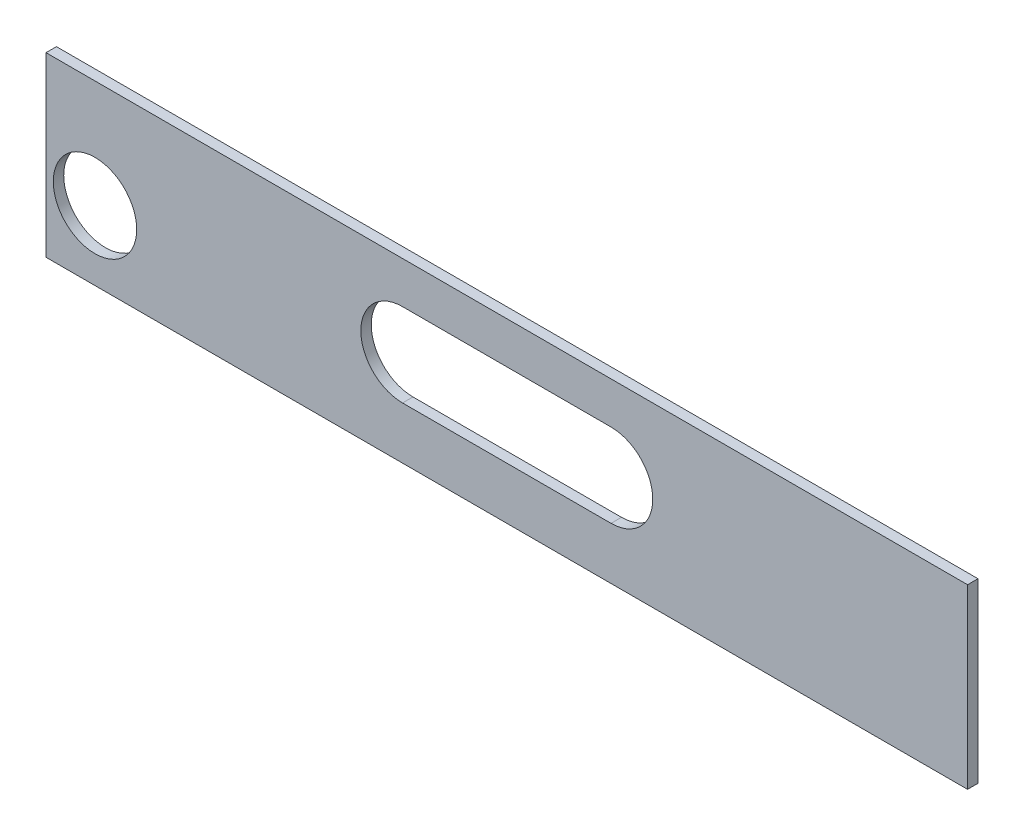
ISO-10303-21;
HEADER;
FILE_DESCRIPTION(('STEP AP214'),'2;1');
FILE_NAME('part.step','',(''),(''),'','','');
FILE_SCHEMA(('AUTOMOTIVE_DESIGN { 1 0 10303 214 1 1 1 1 }'));
ENDSEC;
DATA;
#1=APPLICATION_CONTEXT('core data for automotive mechanical design processes');
#2=APPLICATION_PROTOCOL_DEFINITION('international standard','automotive_design',2000,#1);
#3=PRODUCT_CONTEXT('',#1,'mechanical');
#4=PRODUCT('Part','Part','',(#3));
#5=PRODUCT_RELATED_PRODUCT_CATEGORY('part','',(#4));
#6=PRODUCT_DEFINITION_FORMATION('','',#4);
#7=PRODUCT_DEFINITION_CONTEXT('part definition',#1,'design');
#8=PRODUCT_DEFINITION('design','',#6,#7);
#9=PRODUCT_DEFINITION_SHAPE('','',#8);
#10=(LENGTH_UNIT() NAMED_UNIT(*) SI_UNIT(.MILLI.,.METRE.));
#11=(NAMED_UNIT(*) PLANE_ANGLE_UNIT() SI_UNIT($,.RADIAN.));
#12=(NAMED_UNIT(*) SI_UNIT($,.STERADIAN.) SOLID_ANGLE_UNIT());
#13=UNCERTAINTY_MEASURE_WITH_UNIT(LENGTH_MEASURE(1.E-05),#10,'distance_accuracy_value','');
#14=(GEOMETRIC_REPRESENTATION_CONTEXT(3) GLOBAL_UNCERTAINTY_ASSIGNED_CONTEXT((#13)) GLOBAL_UNIT_ASSIGNED_CONTEXT((#10,
#11,#12)) REPRESENTATION_CONTEXT('',''));
#15=CARTESIAN_POINT('',(0.,0.,0.));
#16=DIRECTION('',(0.,0.,1.));
#17=DIRECTION('',(1.,0.,0.));
#18=AXIS2_PLACEMENT_3D('',#15,#16,#17);
#19=CARTESIAN_POINT('',(-42.1445251800705,-2.63538655559205,1.));
#20=DIRECTION('',(1.,0.,0.));
#21=DIRECTION('',(0.,0.,-1.));
#22=AXIS2_PLACEMENT_3D('',#19,#20,#21);
#23=PLANE('',#22);
#24=DIRECTION('',(0.,-1.,0.));
#25=VECTOR('',#24,1.);
#26=CARTESIAN_POINT('',(-42.1445251800705,-2.63538655559205,0.));
#27=LINE('',#26,#25);
#28=CARTESIAN_POINT('',(-42.1445251800705,-2.63538655559205,0.));
#29=VERTEX_POINT('',#28);
#30=CARTESIAN_POINT('',(-42.1445251800705,-19.635386555592,0.));
#31=VERTEX_POINT('',#30);
#32=EDGE_CURVE('E143',#29,#31,#27,.T.);
#33=ORIENTED_EDGE('',*,*,#32,.T.);
#34=DIRECTION('',(0.,0.,-1.));
#35=VECTOR('',#34,1.);
#36=CARTESIAN_POINT('',(-42.1445251800705,-19.635386555592,1.));
#37=LINE('',#36,#35);
#38=CARTESIAN_POINT('',(-42.1445251800705,-19.635386555592,1.));
#39=VERTEX_POINT('',#38);
#40=EDGE_CURVE('E11',#39,#31,#37,.T.);
#41=ORIENTED_EDGE('',*,*,#40,.F.);
#42=DIRECTION('',(0.,-1.,0.));
#43=VECTOR('',#42,1.);
#44=CARTESIAN_POINT('',(-42.1445251800705,-2.63538655559205,1.));
#45=LINE('',#44,#43);
#46=CARTESIAN_POINT('',(-42.1445251800705,-2.63538655559205,1.));
#47=VERTEX_POINT('',#46);
#48=EDGE_CURVE('E144',#47,#39,#45,.T.);
#49=ORIENTED_EDGE('',*,*,#48,.F.);
#50=DIRECTION('',(0.,0.,-1.));
#51=VECTOR('',#50,1.);
#52=CARTESIAN_POINT('',(-42.1445251800705,-2.63538655559205,1.));
#53=LINE('',#52,#51);
#54=EDGE_CURVE('E154',#47,#29,#53,.T.);
#55=ORIENTED_EDGE('',*,*,#54,.T.);
#56=EDGE_LOOP('',(#33,#41,#49,#55));
#57=FACE_BOUND('',#56,.T.);
#58=ADVANCED_FACE('F38',(#57),#23,.F.);
#59=CARTESIAN_POINT('',(-42.1445251800705,-19.635386555592,1.));
#60=DIRECTION('',(0.,1.,0.));
#61=DIRECTION('',(0.,0.,1.));
#62=AXIS2_PLACEMENT_3D('',#59,#60,#61);
#63=PLANE('',#62);
#64=DIRECTION('',(1.,0.,0.));
#65=VECTOR('',#64,1.);
#66=CARTESIAN_POINT('',(-42.1445251800705,-19.635386555592,0.));
#67=LINE('',#66,#65);
#68=CARTESIAN_POINT('',(46.2554748199295,-19.635386555592,0.));
#69=VERTEX_POINT('',#68);
#70=EDGE_CURVE('E157',#31,#69,#67,.T.);
#71=ORIENTED_EDGE('',*,*,#70,.T.);
#72=DIRECTION('',(0.,0.,-1.));
#73=VECTOR('',#72,1.);
#74=CARTESIAN_POINT('',(46.2554748199295,-19.635386555592,1.));
#75=LINE('',#74,#73);
#76=CARTESIAN_POINT('',(46.2554748199295,-19.635386555592,1.));
#77=VERTEX_POINT('',#76);
#78=EDGE_CURVE('E45',#77,#69,#75,.T.);
#79=ORIENTED_EDGE('',*,*,#78,.F.);
#80=DIRECTION('',(1.,0.,0.));
#81=VECTOR('',#80,1.);
#82=CARTESIAN_POINT('',(-42.1445251800705,-19.635386555592,1.));
#83=LINE('',#82,#81);
#84=EDGE_CURVE('E147',#39,#77,#83,.T.);
#85=ORIENTED_EDGE('',*,*,#84,.F.);
#86=ORIENTED_EDGE('',*,*,#40,.T.);
#87=EDGE_LOOP('',(#71,#79,#85,#86));
#88=FACE_BOUND('',#87,.T.);
#89=ADVANCED_FACE('F186',(#88),#63,.F.);
#90=CARTESIAN_POINT('',(46.2554748199295,-2.63538655559205,1.));
#91=DIRECTION('',(-1.,0.,0.));
#92=DIRECTION('',(0.,-1.,0.));
#93=AXIS2_PLACEMENT_3D('',#90,#91,#92);
#94=PLANE('',#93);
#95=DIRECTION('',(0.,1.,0.));
#96=VECTOR('',#95,1.);
#97=CARTESIAN_POINT('',(46.2554748199295,-2.63538655559205,0.));
#98=LINE('',#97,#96);
#99=CARTESIAN_POINT('',(46.2554748199295,-2.63538655559205,0.));
#100=VERTEX_POINT('',#99);
#101=EDGE_CURVE('E159',#69,#100,#98,.T.);
#102=ORIENTED_EDGE('',*,*,#101,.T.);
#103=DIRECTION('',(0.,0.,-1.));
#104=VECTOR('',#103,1.);
#105=CARTESIAN_POINT('',(46.2554748199295,-2.63538655559205,1.));
#106=LINE('',#105,#104);
#107=CARTESIAN_POINT('',(46.2554748199295,-2.63538655559205,1.));
#108=VERTEX_POINT('',#107);
#109=EDGE_CURVE('E164',#108,#100,#106,.T.);
#110=ORIENTED_EDGE('',*,*,#109,.F.);
#111=DIRECTION('',(0.,1.,0.));
#112=VECTOR('',#111,1.);
#113=CARTESIAN_POINT('',(46.2554748199295,-2.63538655559205,1.));
#114=LINE('',#113,#112);
#115=EDGE_CURVE('E150',#77,#108,#114,.T.);
#116=ORIENTED_EDGE('',*,*,#115,.F.);
#117=ORIENTED_EDGE('',*,*,#78,.T.);
#118=EDGE_LOOP('',(#102,#110,#116,#117));
#119=FACE_BOUND('',#118,.T.);
#120=ADVANCED_FACE('F171',(#119),#94,.F.);
#121=CARTESIAN_POINT('',(-42.1445251800705,-2.63538655559205,1.));
#122=DIRECTION('',(0.,-1.,0.));
#123=DIRECTION('',(0.,0.,-1.));
#124=AXIS2_PLACEMENT_3D('',#121,#122,#123);
#125=PLANE('',#124);
#126=DIRECTION('',(-1.,0.,0.));
#127=VECTOR('',#126,1.);
#128=CARTESIAN_POINT('',(-42.1445251800705,-2.63538655559205,0.));
#129=LINE('',#128,#127);
#130=EDGE_CURVE('E148',#100,#29,#129,.T.);
#131=ORIENTED_EDGE('',*,*,#130,.T.);
#132=ORIENTED_EDGE('',*,*,#54,.F.);
#133=DIRECTION('',(-1.,0.,0.));
#134=VECTOR('',#133,1.);
#135=CARTESIAN_POINT('',(-42.1445251800705,-2.63538655559205,1.));
#136=LINE('',#135,#134);
#137=EDGE_CURVE('E152',#108,#47,#136,.T.);
#138=ORIENTED_EDGE('',*,*,#137,.F.);
#139=ORIENTED_EDGE('',*,*,#109,.T.);
#140=EDGE_LOOP('',(#131,#132,#138,#139));
#141=FACE_BOUND('',#140,.T.);
#142=ADVANCED_FACE('F179',(#141),#125,.F.);
#143=CARTESIAN_POINT('',(0.,0.,1.));
#144=DIRECTION('',(0.,0.,1.));
#145=DIRECTION('',(1.,0.,0.));
#146=AXIS2_PLACEMENT_3D('',#143,#144,#145);
#147=PLANE('',#146);
#148=CARTESIAN_POINT('',(12.0554748199295,-10.635386555592,0.999999999999999));
#149=DIRECTION('',(0.,0.,1.));
#150=DIRECTION('',(1.,0.,0.));
#151=AXIS2_PLACEMENT_3D('',#148,#149,#150);
#152=CIRCLE('',#151,4.);
#153=CARTESIAN_POINT('',(12.0554748199295,-14.635386555592,0.999999999999999));
#154=VERTEX_POINT('',#153);
#155=CARTESIAN_POINT('',(12.0554748199295,-6.63538655559205,0.999999999999999));
#156=VERTEX_POINT('',#155);
#157=EDGE_CURVE('E141',#154,#156,#152,.T.);
#158=ORIENTED_EDGE('',*,*,#157,.F.);
#159=DIRECTION('',(1.,0.,0.));
#160=VECTOR('',#159,1.);
#161=CARTESIAN_POINT('',(0.,-14.635386555592,1.));
#162=LINE('',#161,#160);
#163=CARTESIAN_POINT('',(-7.94452518007047,-14.635386555592,1.));
#164=VERTEX_POINT('',#163);
#165=EDGE_CURVE('E136',#164,#154,#162,.T.);
#166=ORIENTED_EDGE('',*,*,#165,.F.);
#167=CARTESIAN_POINT('',(-7.94452518007047,-10.635386555592,0.999999999999999));
#168=DIRECTION('',(0.,0.,1.));
#169=DIRECTION('',(1.,0.,0.));
#170=AXIS2_PLACEMENT_3D('',#167,#168,#169);
#171=CIRCLE('',#170,4.);
#172=CARTESIAN_POINT('',(-7.94452518007047,-6.63538655559205,0.999999999999999));
#173=VERTEX_POINT('',#172);
#174=EDGE_CURVE('E108',#173,#164,#171,.T.);
#175=ORIENTED_EDGE('',*,*,#174,.F.);
#176=DIRECTION('',(-1.,0.,0.));
#177=VECTOR('',#176,1.);
#178=CARTESIAN_POINT('',(0.,-6.63538655559205,1.));
#179=LINE('',#178,#177);
#180=EDGE_CURVE('E139',#156,#173,#179,.T.);
#181=ORIENTED_EDGE('',*,*,#180,.F.);
#182=EDGE_LOOP('',(#158,#166,#175,#181));
#183=FACE_BOUND('',#182,.T.);
#184=CARTESIAN_POINT('',(-37.4445251800705,-12.985386555592,0.999999999999999));
#185=DIRECTION('',(0.,0.,1.));
#186=DIRECTION('',(1.,0.,0.));
#187=AXIS2_PLACEMENT_3D('',#184,#185,#186);
#188=CIRCLE('',#187,4.);
#189=CARTESIAN_POINT('',(-33.4445251800705,-12.985386555592,0.999999999999999));
#190=VERTEX_POINT('',#189);
#191=EDGE_CURVE('E128',#190,#190,#188,.T.);
#192=ORIENTED_EDGE('',*,*,#191,.F.);
#193=EDGE_LOOP('',(#192));
#194=FACE_BOUND('',#193,.T.);
#195=ORIENTED_EDGE('',*,*,#48,.T.);
#196=ORIENTED_EDGE('',*,*,#84,.T.);
#197=ORIENTED_EDGE('',*,*,#115,.T.);
#198=ORIENTED_EDGE('',*,*,#137,.T.);
#199=EDGE_LOOP('',(#195,#196,#197,#198));
#200=FACE_BOUND('',#199,.T.);
#201=ADVANCED_FACE('F185',(#183,#194,#200),#147,.T.);
#202=CARTESIAN_POINT('',(0.,0.,0.));
#203=DIRECTION('',(0.,0.,1.));
#204=DIRECTION('',(1.,0.,0.));
#205=AXIS2_PLACEMENT_3D('',#202,#203,#204);
#206=PLANE('',#205);
#207=DIRECTION('',(-1.,0.,0.));
#208=VECTOR('',#207,1.);
#209=CARTESIAN_POINT('',(12.0554748199295,-14.635386555592,0.));
#210=LINE('',#209,#208);
#211=CARTESIAN_POINT('',(12.0554748199295,-14.635386555592,0.));
#212=VERTEX_POINT('',#211);
#213=CARTESIAN_POINT('',(-7.94452518007047,-14.635386555592,0.));
#214=VERTEX_POINT('',#213);
#215=EDGE_CURVE('E114',#212,#214,#210,.T.);
#216=ORIENTED_EDGE('',*,*,#215,.F.);
#217=CARTESIAN_POINT('',(12.0554748199295,-10.635386555592,0.));
#218=DIRECTION('',(0.,0.,-1.));
#219=DIRECTION('',(-1.,0.,0.));
#220=AXIS2_PLACEMENT_3D('',#217,#218,#219);
#221=CIRCLE('',#220,4.);
#222=CARTESIAN_POINT('',(12.0554748199295,-6.63538655559205,0.));
#223=VERTEX_POINT('',#222);
#224=EDGE_CURVE('E60',#223,#212,#221,.T.);
#225=ORIENTED_EDGE('',*,*,#224,.F.);
#226=DIRECTION('',(1.,0.,0.));
#227=VECTOR('',#226,1.);
#228=CARTESIAN_POINT('',(12.0554748199295,-6.63538655559205,0.));
#229=LINE('',#228,#227);
#230=CARTESIAN_POINT('',(-7.94452518007047,-6.63538655559205,0.));
#231=VERTEX_POINT('',#230);
#232=EDGE_CURVE('E121',#231,#223,#229,.T.);
#233=ORIENTED_EDGE('',*,*,#232,.F.);
#234=CARTESIAN_POINT('',(-7.94452518007047,-10.635386555592,0.));
#235=DIRECTION('',(0.,0.,-1.));
#236=DIRECTION('',(-1.,0.,0.));
#237=AXIS2_PLACEMENT_3D('',#234,#235,#236);
#238=CIRCLE('',#237,4.);
#239=EDGE_CURVE('E105',#214,#231,#238,.T.);
#240=ORIENTED_EDGE('',*,*,#239,.F.);
#241=EDGE_LOOP('',(#216,#225,#233,#240));
#242=FACE_BOUND('',#241,.T.);
#243=CARTESIAN_POINT('',(-37.4445251800705,-12.985386555592,0.));
#244=DIRECTION('',(0.,0.,-1.));
#245=DIRECTION('',(-1.,0.,0.));
#246=AXIS2_PLACEMENT_3D('',#243,#244,#245);
#247=CIRCLE('',#246,4.);
#248=CARTESIAN_POINT('',(-41.4445251800705,-12.985386555592,0.));
#249=VERTEX_POINT('',#248);
#250=EDGE_CURVE('E131',#249,#249,#247,.T.);
#251=ORIENTED_EDGE('',*,*,#250,.F.);
#252=EDGE_LOOP('',(#251));
#253=FACE_BOUND('',#252,.T.);
#254=ORIENTED_EDGE('',*,*,#32,.F.);
#255=ORIENTED_EDGE('',*,*,#130,.F.);
#256=ORIENTED_EDGE('',*,*,#101,.F.);
#257=ORIENTED_EDGE('',*,*,#70,.F.);
#258=EDGE_LOOP('',(#254,#255,#256,#257));
#259=FACE_BOUND('',#258,.T.);
#260=ADVANCED_FACE('F118',(#242,#253,#259),#206,.F.);
#261=CARTESIAN_POINT('',(-37.4445251800705,-12.985386555592,10.));
#262=DIRECTION('',(0.,0.,-1.));
#263=DIRECTION('',(-1.,0.,0.));
#264=AXIS2_PLACEMENT_3D('',#261,#262,#263);
#265=CYLINDRICAL_SURFACE('',#264,4.);
#266=ORIENTED_EDGE('',*,*,#191,.T.);
#267=EDGE_LOOP('',(#266));
#268=FACE_BOUND('',#267,.T.);
#269=ORIENTED_EDGE('',*,*,#250,.T.);
#270=EDGE_LOOP('',(#269));
#271=FACE_BOUND('',#270,.T.);
#272=ADVANCED_FACE('F198',(#268,#271),#265,.F.);
#273=CARTESIAN_POINT('',(12.0554748199295,-10.635386555592,10.));
#274=DIRECTION('',(0.,0.,-1.));
#275=DIRECTION('',(-1.,0.,0.));
#276=AXIS2_PLACEMENT_3D('',#273,#274,#275);
#277=CYLINDRICAL_SURFACE('',#276,4.);
#278=ORIENTED_EDGE('',*,*,#157,.T.);
#279=DIRECTION('',(0.,0.,-1.));
#280=VECTOR('',#279,1.);
#281=CARTESIAN_POINT('',(12.0554748199295,-6.63538655559205,10.));
#282=LINE('',#281,#280);
#283=EDGE_CURVE('E126',#156,#223,#282,.T.);
#284=ORIENTED_EDGE('',*,*,#283,.T.);
#285=ORIENTED_EDGE('',*,*,#224,.T.);
#286=DIRECTION('',(0.,0.,-1.));
#287=VECTOR('',#286,1.);
#288=CARTESIAN_POINT('',(12.0554748199295,-14.635386555592,10.));
#289=LINE('',#288,#287);
#290=EDGE_CURVE('E111',#154,#212,#289,.T.);
#291=ORIENTED_EDGE('',*,*,#290,.F.);
#292=EDGE_LOOP('',(#278,#284,#285,#291));
#293=FACE_BOUND('',#292,.T.);
#294=ADVANCED_FACE('F204',(#293),#277,.F.);
#295=CARTESIAN_POINT('',(12.0554748199295,-6.63538655559205,10.));
#296=DIRECTION('',(0.,1.,0.));
#297=DIRECTION('',(0.,0.,1.));
#298=AXIS2_PLACEMENT_3D('',#295,#296,#297);
#299=PLANE('',#298);
#300=ORIENTED_EDGE('',*,*,#180,.T.);
#301=DIRECTION('',(0.,0.,-1.));
#302=VECTOR('',#301,1.);
#303=CARTESIAN_POINT('',(-7.94452518007047,-6.63538655559205,10.));
#304=LINE('',#303,#302);
#305=EDGE_CURVE('E110',#173,#231,#304,.T.);
#306=ORIENTED_EDGE('',*,*,#305,.T.);
#307=ORIENTED_EDGE('',*,*,#232,.T.);
#308=ORIENTED_EDGE('',*,*,#283,.F.);
#309=EDGE_LOOP('',(#300,#306,#307,#308));
#310=FACE_BOUND('',#309,.T.);
#311=ADVANCED_FACE('F208',(#310),#299,.F.);
#312=CARTESIAN_POINT('',(-7.94452518007047,-10.635386555592,10.));
#313=DIRECTION('',(0.,0.,-1.));
#314=DIRECTION('',(-1.,0.,0.));
#315=AXIS2_PLACEMENT_3D('',#312,#313,#314);
#316=CYLINDRICAL_SURFACE('',#315,4.);
#317=ORIENTED_EDGE('',*,*,#174,.T.);
#318=DIRECTION('',(0.,0.,-1.));
#319=VECTOR('',#318,1.);
#320=CARTESIAN_POINT('',(-7.94452518007047,-14.635386555592,10.));
#321=LINE('',#320,#319);
#322=EDGE_CURVE('E52',#164,#214,#321,.T.);
#323=ORIENTED_EDGE('',*,*,#322,.T.);
#324=ORIENTED_EDGE('',*,*,#239,.T.);
#325=ORIENTED_EDGE('',*,*,#305,.F.);
#326=EDGE_LOOP('',(#317,#323,#324,#325));
#327=FACE_BOUND('',#326,.T.);
#328=ADVANCED_FACE('F102',(#327),#316,.F.);
#329=CARTESIAN_POINT('',(12.0554748199295,-14.635386555592,10.));
#330=DIRECTION('',(0.,-1.,0.));
#331=DIRECTION('',(0.,0.,-1.));
#332=AXIS2_PLACEMENT_3D('',#329,#330,#331);
#333=PLANE('',#332);
#334=ORIENTED_EDGE('',*,*,#165,.T.);
#335=ORIENTED_EDGE('',*,*,#290,.T.);
#336=ORIENTED_EDGE('',*,*,#215,.T.);
#337=ORIENTED_EDGE('',*,*,#322,.F.);
#338=EDGE_LOOP('',(#334,#335,#336,#337));
#339=FACE_BOUND('',#338,.T.);
#340=ADVANCED_FACE('F115',(#339),#333,.F.);
#341=CLOSED_SHELL('',(#58,#89,#120,#142,#201,#260,#272,#294,#311,#328,#340));
#342=MANIFOLD_SOLID_BREP('B2',#341);
#343=ADVANCED_BREP_SHAPE_REPRESENTATION('',(#18,#342),#14);
#344=SHAPE_DEFINITION_REPRESENTATION(#9,#343);
ENDSEC;
END-ISO-10303-21;
